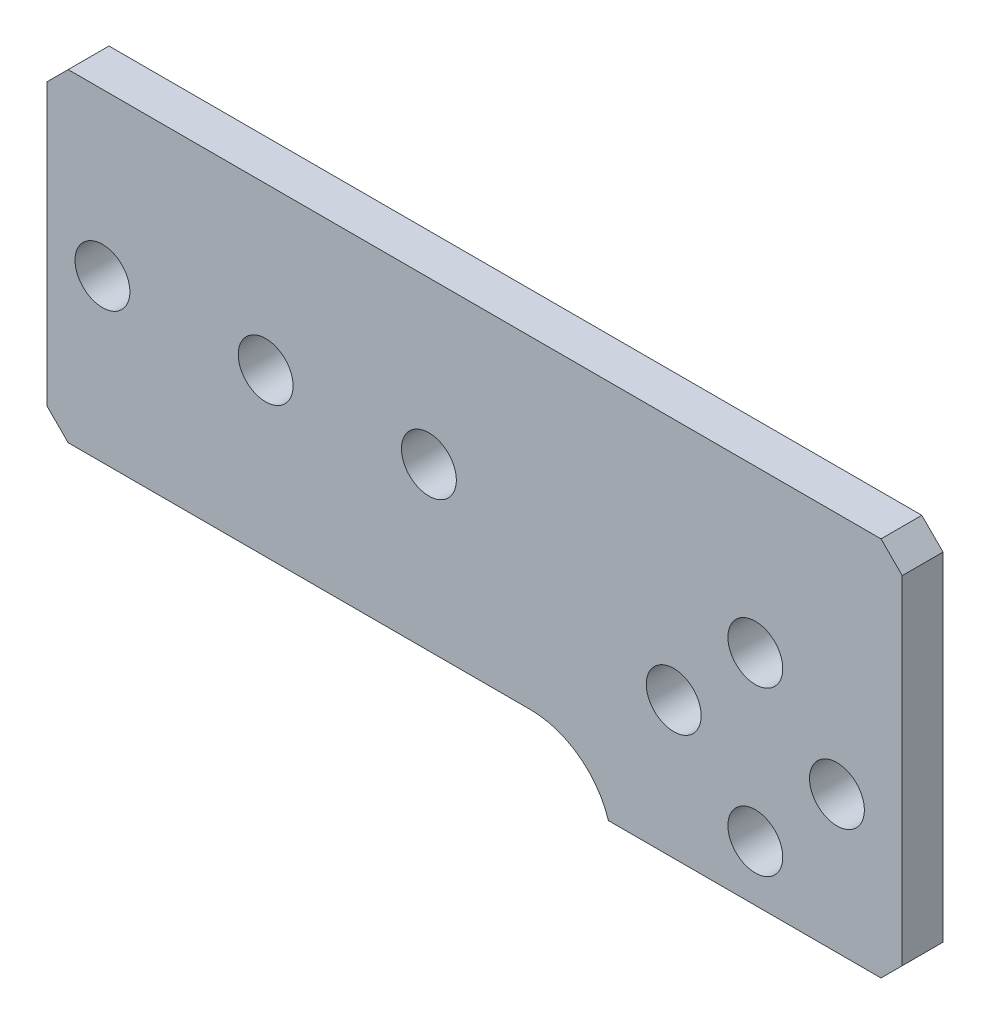
ISO-10303-21;
HEADER;
FILE_DESCRIPTION(('STEP AP214'),'2;1');
FILE_NAME('part.step','',(''),(''),'','','');
FILE_SCHEMA(('AUTOMOTIVE_DESIGN { 1 0 10303 214 1 1 1 1 }'));
ENDSEC;
DATA;
#1=APPLICATION_CONTEXT('core data for automotive mechanical design processes');
#2=APPLICATION_PROTOCOL_DEFINITION('international standard','automotive_design',2000,#1);
#3=PRODUCT_CONTEXT('',#1,'mechanical');
#4=PRODUCT('Part','Part','',(#3));
#5=PRODUCT_RELATED_PRODUCT_CATEGORY('part','',(#4));
#6=PRODUCT_DEFINITION_FORMATION('','',#4);
#7=PRODUCT_DEFINITION_CONTEXT('part definition',#1,'design');
#8=PRODUCT_DEFINITION('design','',#6,#7);
#9=PRODUCT_DEFINITION_SHAPE('','',#8);
#10=(LENGTH_UNIT() NAMED_UNIT(*) SI_UNIT(.MILLI.,.METRE.));
#11=(NAMED_UNIT(*) PLANE_ANGLE_UNIT() SI_UNIT($,.RADIAN.));
#12=(NAMED_UNIT(*) SI_UNIT($,.STERADIAN.) SOLID_ANGLE_UNIT());
#13=UNCERTAINTY_MEASURE_WITH_UNIT(LENGTH_MEASURE(1.E-05),#10,'distance_accuracy_value','');
#14=(GEOMETRIC_REPRESENTATION_CONTEXT(3) GLOBAL_UNCERTAINTY_ASSIGNED_CONTEXT((#13)) GLOBAL_UNIT_ASSIGNED_CONTEXT((#10,
#11,#12)) REPRESENTATION_CONTEXT('',''));
#15=CARTESIAN_POINT('',(0.,0.,0.));
#16=DIRECTION('',(0.,0.,1.));
#17=DIRECTION('',(1.,0.,0.));
#18=AXIS2_PLACEMENT_3D('',#15,#16,#17);
#19=CARTESIAN_POINT('',(0.,0.,1.5875));
#20=DIRECTION('',(0.,0.,1.));
#21=DIRECTION('',(1.,0.,0.));
#22=AXIS2_PLACEMENT_3D('',#19,#20,#21);
#23=PLANE('',#22);
#24=CARTESIAN_POINT('',(25.4,0.,1.5875));
#25=DIRECTION('',(0.,0.,-1.));
#26=DIRECTION('',(-1.,0.,0.));
#27=AXIS2_PLACEMENT_3D('',#24,#25,#26);
#28=CIRCLE('',#27,2.1336);
#29=CARTESIAN_POINT('',(23.2664,0.,1.5875));
#30=VERTEX_POINT('',#29);
#31=EDGE_CURVE('E182',#30,#30,#28,.T.);
#32=ORIENTED_EDGE('',*,*,#31,.T.);
#33=EDGE_LOOP('',(#32));
#34=FACE_BOUND('',#33,.T.);
#35=CARTESIAN_POINT('',(19.05,-6.35,1.5875));
#36=DIRECTION('',(0.,0.,-1.));
#37=DIRECTION('',(-1.,0.,0.));
#38=AXIS2_PLACEMENT_3D('',#35,#36,#37);
#39=CIRCLE('',#38,2.1336);
#40=CARTESIAN_POINT('',(16.9164,-6.35,1.5875));
#41=VERTEX_POINT('',#40);
#42=EDGE_CURVE('E185',#41,#41,#39,.T.);
#43=ORIENTED_EDGE('',*,*,#42,.T.);
#44=EDGE_LOOP('',(#43));
#45=FACE_BOUND('',#44,.T.);
#46=CARTESIAN_POINT('',(25.4,-12.7,1.5875));
#47=DIRECTION('',(0.,0.,-1.));
#48=DIRECTION('',(-1.,0.,0.));
#49=AXIS2_PLACEMENT_3D('',#46,#47,#48);
#50=CIRCLE('',#49,2.1336);
#51=CARTESIAN_POINT('',(23.2664,-12.7,1.5875));
#52=VERTEX_POINT('',#51);
#53=EDGE_CURVE('E115',#52,#52,#50,.T.);
#54=ORIENTED_EDGE('',*,*,#53,.T.);
#55=EDGE_LOOP('',(#54));
#56=FACE_BOUND('',#55,.T.);
#57=CARTESIAN_POINT('',(31.75,-6.35,1.5875));
#58=DIRECTION('',(0.,0.,-1.));
#59=DIRECTION('',(-1.,0.,0.));
#60=AXIS2_PLACEMENT_3D('',#57,#58,#59);
#61=CIRCLE('',#60,2.1336);
#62=CARTESIAN_POINT('',(29.6164,-6.35,1.5875));
#63=VERTEX_POINT('',#62);
#64=EDGE_CURVE('E112',#63,#63,#61,.T.);
#65=ORIENTED_EDGE('',*,*,#64,.T.);
#66=EDGE_LOOP('',(#65));
#67=FACE_BOUND('',#66,.T.);
#68=DIRECTION('',(-1.,0.,0.));
#69=VECTOR('',#68,1.);
#70=CARTESIAN_POINT('',(0.,12.573,1.5875));
#71=LINE('',#70,#69);
#72=CARTESIAN_POINT('',(-28.067,12.573,1.5875));
#73=VERTEX_POINT('',#72);
#74=CARTESIAN_POINT('',(35.179,12.573,1.5875));
#75=VERTEX_POINT('',#74);
#76=EDGE_CURVE('E137',#73,#75,#71,.F.);
#77=ORIENTED_EDGE('',*,*,#76,.F.);
#78=DIRECTION('',(0.707106781186549,0.707106781186546,0.));
#79=VECTOR('',#78,1.);
#80=CARTESIAN_POINT('',(-29.718,10.922,1.5875));
#81=LINE('',#80,#79);
#82=CARTESIAN_POINT('',(-29.718,10.922,1.5875));
#83=VERTEX_POINT('',#82);
#84=EDGE_CURVE('E129',#73,#83,#81,.F.);
#85=ORIENTED_EDGE('',*,*,#84,.T.);
#86=DIRECTION('',(0.,1.,0.));
#87=VECTOR('',#86,1.);
#88=CARTESIAN_POINT('',(-29.718,0.,1.5875));
#89=LINE('',#88,#87);
#90=CARTESIAN_POINT('',(-29.718,-10.922,1.5875));
#91=VERTEX_POINT('',#90);
#92=EDGE_CURVE('E127',#91,#83,#89,.T.);
#93=ORIENTED_EDGE('',*,*,#92,.F.);
#94=DIRECTION('',(0.707106781186545,-0.707106781186551,0.));
#95=VECTOR('',#94,1.);
#96=CARTESIAN_POINT('',(-28.067,-12.573,1.5875));
#97=LINE('',#96,#95);
#98=CARTESIAN_POINT('',(-28.067,-12.573,1.5875));
#99=VERTEX_POINT('',#98);
#100=EDGE_CURVE('E111',#99,#91,#97,.F.);
#101=ORIENTED_EDGE('',*,*,#100,.F.);
#102=DIRECTION('',(-1.,0.,0.));
#103=VECTOR('',#102,1.);
#104=CARTESIAN_POINT('',(0.,-12.573,1.5875));
#105=LINE('',#104,#103);
#106=CARTESIAN_POINT('',(7.91248607100239,-12.573,1.5875));
#107=VERTEX_POINT('',#106);
#108=EDGE_CURVE('E105',#99,#107,#105,.F.);
#109=ORIENTED_EDGE('',*,*,#108,.T.);
#110=CARTESIAN_POINT('',(7.91248607100239,-18.923,1.5875));
#111=DIRECTION('',(0.,0.,-1.));
#112=DIRECTION('',(-1.,0.,0.));
#113=AXIS2_PLACEMENT_3D('',#110,#111,#112);
#114=CIRCLE('',#113,6.35);
#115=CARTESIAN_POINT('',(13.97,-17.018,1.5875));
#116=VERTEX_POINT('',#115);
#117=EDGE_CURVE('E93',#107,#116,#114,.T.);
#118=ORIENTED_EDGE('',*,*,#117,.T.);
#119=DIRECTION('',(1.,0.,0.));
#120=VECTOR('',#119,1.);
#121=CARTESIAN_POINT('',(0.,-17.018,1.5875));
#122=LINE('',#121,#120);
#123=CARTESIAN_POINT('',(35.179,-17.018,1.5875));
#124=VERTEX_POINT('',#123);
#125=EDGE_CURVE('E158',#116,#124,#122,.T.);
#126=ORIENTED_EDGE('',*,*,#125,.T.);
#127=DIRECTION('',(-0.707106781186549,-0.707106781186546,0.));
#128=VECTOR('',#127,1.);
#129=CARTESIAN_POINT('',(36.83,-15.367,1.5875));
#130=LINE('',#129,#128);
#131=CARTESIAN_POINT('',(36.83,-15.367,1.5875));
#132=VERTEX_POINT('',#131);
#133=EDGE_CURVE('E153',#124,#132,#130,.F.);
#134=ORIENTED_EDGE('',*,*,#133,.T.);
#135=DIRECTION('',(0.,1.,0.));
#136=VECTOR('',#135,1.);
#137=CARTESIAN_POINT('',(36.83,0.,1.5875));
#138=LINE('',#137,#136);
#139=CARTESIAN_POINT('',(36.83,10.922,1.5875));
#140=VERTEX_POINT('',#139);
#141=EDGE_CURVE('E145',#132,#140,#138,.T.);
#142=ORIENTED_EDGE('',*,*,#141,.T.);
#143=DIRECTION('',(-0.707106781186546,0.707106781186549,0.));
#144=VECTOR('',#143,1.);
#145=CARTESIAN_POINT('',(35.179,12.573,1.5875));
#146=LINE('',#145,#144);
#147=EDGE_CURVE('E143',#75,#140,#146,.F.);
#148=ORIENTED_EDGE('',*,*,#147,.F.);
#149=EDGE_LOOP('',(#77,#85,#93,#101,#109,#118,#126,#134,#142,#148));
#150=FACE_BOUND('',#149,.T.);
#151=CARTESIAN_POINT('',(0.,0.,1.5875));
#152=DIRECTION('',(0.,0.,-1.));
#153=DIRECTION('',(-1.,0.,0.));
#154=AXIS2_PLACEMENT_3D('',#151,#152,#153);
#155=CIRCLE('',#154,2.1336);
#156=CARTESIAN_POINT('',(-2.1336,0.,1.5875));
#157=VERTEX_POINT('',#156);
#158=EDGE_CURVE('E102',#157,#157,#155,.T.);
#159=ORIENTED_EDGE('',*,*,#158,.T.);
#160=EDGE_LOOP('',(#159));
#161=FACE_BOUND('',#160,.T.);
#162=CARTESIAN_POINT('',(-12.7,0.,1.5875));
#163=DIRECTION('',(0.,0.,-1.));
#164=DIRECTION('',(-1.,0.,0.));
#165=AXIS2_PLACEMENT_3D('',#162,#163,#164);
#166=CIRCLE('',#165,2.1336);
#167=CARTESIAN_POINT('',(-14.8336,0.,1.5875));
#168=VERTEX_POINT('',#167);
#169=EDGE_CURVE('E191',#168,#168,#166,.T.);
#170=ORIENTED_EDGE('',*,*,#169,.T.);
#171=EDGE_LOOP('',(#170));
#172=FACE_BOUND('',#171,.T.);
#173=CARTESIAN_POINT('',(-25.4,-1.77367252013231E-13,1.5875));
#174=DIRECTION('',(0.,0.,-1.));
#175=DIRECTION('',(-1.,0.,0.));
#176=AXIS2_PLACEMENT_3D('',#173,#174,#175);
#177=CIRCLE('',#176,2.1336);
#178=CARTESIAN_POINT('',(-27.5336,-1.77367252013231E-13,1.5875));
#179=VERTEX_POINT('',#178);
#180=EDGE_CURVE('E20',#179,#179,#177,.T.);
#181=ORIENTED_EDGE('',*,*,#180,.T.);
#182=EDGE_LOOP('',(#181));
#183=FACE_BOUND('',#182,.T.);
#184=ADVANCED_FACE('F17',(#34,#45,#56,#67,#150,#161,#172,#183),#23,.T.);
#185=CARTESIAN_POINT('',(-25.4,-1.77367252013231E-13,1.5875));
#186=DIRECTION('',(0.,0.,-1.));
#187=DIRECTION('',(-1.,0.,0.));
#188=AXIS2_PLACEMENT_3D('',#185,#186,#187);
#189=CYLINDRICAL_SURFACE('',#188,2.1336);
#190=CARTESIAN_POINT('',(-25.4,-1.77367252013231E-13,-1.5875));
#191=DIRECTION('',(0.,0.,-1.));
#192=DIRECTION('',(-1.,0.,0.));
#193=AXIS2_PLACEMENT_3D('',#190,#191,#192);
#194=CIRCLE('',#193,2.1336);
#195=CARTESIAN_POINT('',(-27.5336,-1.77367252013231E-13,-1.5875));
#196=VERTEX_POINT('',#195);
#197=EDGE_CURVE('E179',#196,#196,#194,.T.);
#198=ORIENTED_EDGE('',*,*,#197,.T.);
#199=EDGE_LOOP('',(#198));
#200=FACE_BOUND('',#199,.T.);
#201=ORIENTED_EDGE('',*,*,#180,.F.);
#202=EDGE_LOOP('',(#201));
#203=FACE_BOUND('',#202,.T.);
#204=ADVANCED_FACE('F199',(#200,#203),#189,.F.);
#205=CARTESIAN_POINT('',(-12.7,0.,1.5875));
#206=DIRECTION('',(0.,0.,-1.));
#207=DIRECTION('',(-1.,0.,0.));
#208=AXIS2_PLACEMENT_3D('',#205,#206,#207);
#209=CYLINDRICAL_SURFACE('',#208,2.1336);
#210=CARTESIAN_POINT('',(-12.7,0.,-1.5875));
#211=DIRECTION('',(0.,0.,-1.));
#212=DIRECTION('',(-1.,0.,0.));
#213=AXIS2_PLACEMENT_3D('',#210,#211,#212);
#214=CIRCLE('',#213,2.1336);
#215=CARTESIAN_POINT('',(-14.8336,0.,-1.5875));
#216=VERTEX_POINT('',#215);
#217=EDGE_CURVE('E176',#216,#216,#214,.T.);
#218=ORIENTED_EDGE('',*,*,#217,.T.);
#219=EDGE_LOOP('',(#218));
#220=FACE_BOUND('',#219,.T.);
#221=ORIENTED_EDGE('',*,*,#169,.F.);
#222=EDGE_LOOP('',(#221));
#223=FACE_BOUND('',#222,.T.);
#224=ADVANCED_FACE('F201',(#220,#223),#209,.F.);
#225=CARTESIAN_POINT('',(0.,0.,1.5875));
#226=DIRECTION('',(0.,0.,-1.));
#227=DIRECTION('',(-1.,0.,0.));
#228=AXIS2_PLACEMENT_3D('',#225,#226,#227);
#229=CYLINDRICAL_SURFACE('',#228,2.1336);
#230=CARTESIAN_POINT('',(0.,0.,-1.5875));
#231=DIRECTION('',(0.,0.,-1.));
#232=DIRECTION('',(-1.,0.,0.));
#233=AXIS2_PLACEMENT_3D('',#230,#231,#232);
#234=CIRCLE('',#233,2.1336);
#235=CARTESIAN_POINT('',(-2.1336,0.,-1.5875));
#236=VERTEX_POINT('',#235);
#237=EDGE_CURVE('E173',#236,#236,#234,.T.);
#238=ORIENTED_EDGE('',*,*,#237,.T.);
#239=EDGE_LOOP('',(#238));
#240=FACE_BOUND('',#239,.T.);
#241=ORIENTED_EDGE('',*,*,#158,.F.);
#242=EDGE_LOOP('',(#241));
#243=FACE_BOUND('',#242,.T.);
#244=ADVANCED_FACE('F208',(#240,#243),#229,.F.);
#245=CARTESIAN_POINT('',(7.91248607100239,-18.923,1.5875));
#246=DIRECTION('',(0.,0.,-1.));
#247=DIRECTION('',(-1.,0.,0.));
#248=AXIS2_PLACEMENT_3D('',#245,#246,#247);
#249=CYLINDRICAL_SURFACE('',#248,6.35);
#250=DIRECTION('',(0.,0.,1.));
#251=VECTOR('',#250,1.);
#252=CARTESIAN_POINT('',(7.91248607100239,-12.573,1.5875));
#253=LINE('',#252,#251);
#254=CARTESIAN_POINT('',(7.91248607100239,-12.573,-1.5875));
#255=VERTEX_POINT('',#254);
#256=EDGE_CURVE('E97',#107,#255,#253,.F.);
#257=ORIENTED_EDGE('',*,*,#256,.T.);
#258=CARTESIAN_POINT('',(7.91248607100239,-18.923,-1.5875));
#259=DIRECTION('',(0.,0.,-1.));
#260=DIRECTION('',(-1.,0.,0.));
#261=AXIS2_PLACEMENT_3D('',#258,#259,#260);
#262=CIRCLE('',#261,6.35);
#263=CARTESIAN_POINT('',(13.97,-17.018,-1.5875));
#264=VERTEX_POINT('',#263);
#265=EDGE_CURVE('E170',#255,#264,#262,.T.);
#266=ORIENTED_EDGE('',*,*,#265,.T.);
#267=DIRECTION('',(0.,0.,1.));
#268=VECTOR('',#267,1.);
#269=CARTESIAN_POINT('',(13.97,-17.018,1.5875));
#270=LINE('',#269,#268);
#271=EDGE_CURVE('E98',#264,#116,#270,.T.);
#272=ORIENTED_EDGE('',*,*,#271,.T.);
#273=ORIENTED_EDGE('',*,*,#117,.F.);
#274=EDGE_LOOP('',(#257,#266,#272,#273));
#275=FACE_BOUND('',#274,.T.);
#276=ADVANCED_FACE('F95',(#275),#249,.F.);
#277=CARTESIAN_POINT('',(0.,-17.018,1.5875));
#278=DIRECTION('',(0.,1.,0.));
#279=DIRECTION('',(0.,0.,1.));
#280=AXIS2_PLACEMENT_3D('',#277,#278,#279);
#281=PLANE('',#280);
#282=DIRECTION('',(0.,0.,1.));
#283=VECTOR('',#282,1.);
#284=CARTESIAN_POINT('',(35.179,-17.018,1.5875));
#285=LINE('',#284,#283);
#286=CARTESIAN_POINT('',(35.179,-17.018,-1.5875));
#287=VERTEX_POINT('',#286);
#288=EDGE_CURVE('E155',#287,#124,#285,.T.);
#289=ORIENTED_EDGE('',*,*,#288,.T.);
#290=ORIENTED_EDGE('',*,*,#125,.F.);
#291=ORIENTED_EDGE('',*,*,#271,.F.);
#292=DIRECTION('',(1.,0.,0.));
#293=VECTOR('',#292,1.);
#294=CARTESIAN_POINT('',(0.,-17.018,-1.5875));
#295=LINE('',#294,#293);
#296=EDGE_CURVE('E172',#264,#287,#295,.T.);
#297=ORIENTED_EDGE('',*,*,#296,.T.);
#298=EDGE_LOOP('',(#289,#290,#291,#297));
#299=FACE_BOUND('',#298,.T.);
#300=ADVANCED_FACE('F266',(#299),#281,.F.);
#301=CARTESIAN_POINT('',(36.83,-15.367,1.5875));
#302=DIRECTION('',(-0.707106781186546,0.707106781186549,0.));
#303=DIRECTION('',(-0.707106781186549,-0.707106781186546,0.));
#304=AXIS2_PLACEMENT_3D('',#301,#302,#303);
#305=PLANE('',#304);
#306=ORIENTED_EDGE('',*,*,#288,.F.);
#307=DIRECTION('',(0.707106781186549,0.707106781186546,0.));
#308=VECTOR('',#307,1.);
#309=CARTESIAN_POINT('',(35.179,-17.018,-1.5875));
#310=LINE('',#309,#308);
#311=CARTESIAN_POINT('',(36.83,-15.367,-1.5875));
#312=VERTEX_POINT('',#311);
#313=EDGE_CURVE('E412',#287,#312,#310,.T.);
#314=ORIENTED_EDGE('',*,*,#313,.T.);
#315=DIRECTION('',(0.,0.,1.));
#316=VECTOR('',#315,1.);
#317=CARTESIAN_POINT('',(36.83,-15.367,1.5875));
#318=LINE('',#317,#316);
#319=EDGE_CURVE('E150',#312,#132,#318,.T.);
#320=ORIENTED_EDGE('',*,*,#319,.T.);
#321=ORIENTED_EDGE('',*,*,#133,.F.);
#322=EDGE_LOOP('',(#306,#314,#320,#321));
#323=FACE_BOUND('',#322,.T.);
#324=ADVANCED_FACE('F262',(#323),#305,.F.);
#325=CARTESIAN_POINT('',(36.83,0.,1.5875));
#326=DIRECTION('',(-1.,0.,0.));
#327=DIRECTION('',(0.,0.,1.));
#328=AXIS2_PLACEMENT_3D('',#325,#326,#327);
#329=PLANE('',#328);
#330=DIRECTION('',(0.,0.,1.));
#331=VECTOR('',#330,1.);
#332=CARTESIAN_POINT('',(36.83,10.922,1.5875));
#333=LINE('',#332,#331);
#334=CARTESIAN_POINT('',(36.83,10.922,-1.5875));
#335=VERTEX_POINT('',#334);
#336=EDGE_CURVE('E140',#140,#335,#333,.F.);
#337=ORIENTED_EDGE('',*,*,#336,.F.);
#338=ORIENTED_EDGE('',*,*,#141,.F.);
#339=ORIENTED_EDGE('',*,*,#319,.F.);
#340=DIRECTION('',(0.,1.,0.));
#341=VECTOR('',#340,1.);
#342=CARTESIAN_POINT('',(36.83,0.,-1.5875));
#343=LINE('',#342,#341);
#344=EDGE_CURVE('E414',#312,#335,#343,.T.);
#345=ORIENTED_EDGE('',*,*,#344,.T.);
#346=EDGE_LOOP('',(#337,#338,#339,#345));
#347=FACE_BOUND('',#346,.T.);
#348=ADVANCED_FACE('F258',(#347),#329,.F.);
#349=CARTESIAN_POINT('',(35.179,12.573,1.5875));
#350=DIRECTION('',(0.707106781186549,0.707106781186546,0.));
#351=DIRECTION('',(-0.707106781186546,0.707106781186549,0.));
#352=AXIS2_PLACEMENT_3D('',#349,#350,#351);
#353=PLANE('',#352);
#354=DIRECTION('',(-0.707106781186546,0.707106781186549,0.));
#355=VECTOR('',#354,1.);
#356=CARTESIAN_POINT('',(36.83,10.922,-1.5875));
#357=LINE('',#356,#355);
#358=CARTESIAN_POINT('',(35.179,12.573,-1.5875));
#359=VERTEX_POINT('',#358);
#360=EDGE_CURVE('E423',#335,#359,#357,.T.);
#361=ORIENTED_EDGE('',*,*,#360,.T.);
#362=DIRECTION('',(0.,0.,1.));
#363=VECTOR('',#362,1.);
#364=CARTESIAN_POINT('',(35.179,12.573,1.5875));
#365=LINE('',#364,#363);
#366=EDGE_CURVE('E139',#75,#359,#365,.F.);
#367=ORIENTED_EDGE('',*,*,#366,.F.);
#368=ORIENTED_EDGE('',*,*,#147,.T.);
#369=ORIENTED_EDGE('',*,*,#336,.T.);
#370=EDGE_LOOP('',(#361,#367,#368,#369));
#371=FACE_BOUND('',#370,.T.);
#372=ADVANCED_FACE('F254',(#371),#353,.T.);
#373=CARTESIAN_POINT('',(0.,12.573,1.5875));
#374=DIRECTION('',(0.,1.,0.));
#375=DIRECTION('',(-1.,0.,0.));
#376=AXIS2_PLACEMENT_3D('',#373,#374,#375);
#377=PLANE('',#376);
#378=ORIENTED_EDGE('',*,*,#76,.T.);
#379=ORIENTED_EDGE('',*,*,#366,.T.);
#380=DIRECTION('',(1.,0.,0.));
#381=VECTOR('',#380,1.);
#382=CARTESIAN_POINT('',(0.,12.573,-1.5875));
#383=LINE('',#382,#381);
#384=CARTESIAN_POINT('',(-28.067,12.573,-1.5875));
#385=VERTEX_POINT('',#384);
#386=EDGE_CURVE('E431',#359,#385,#383,.F.);
#387=ORIENTED_EDGE('',*,*,#386,.T.);
#388=DIRECTION('',(0.,0.,1.));
#389=VECTOR('',#388,1.);
#390=CARTESIAN_POINT('',(-28.067,12.573,1.5875));
#391=LINE('',#390,#389);
#392=EDGE_CURVE('E134',#385,#73,#391,.T.);
#393=ORIENTED_EDGE('',*,*,#392,.T.);
#394=EDGE_LOOP('',(#378,#379,#387,#393));
#395=FACE_BOUND('',#394,.T.);
#396=ADVANCED_FACE('F250',(#395),#377,.T.);
#397=CARTESIAN_POINT('',(-29.718,10.922,1.5875));
#398=DIRECTION('',(0.707106781186546,-0.707106781186549,0.));
#399=DIRECTION('',(0.707106781186549,0.707106781186546,0.));
#400=AXIS2_PLACEMENT_3D('',#397,#398,#399);
#401=PLANE('',#400);
#402=ORIENTED_EDGE('',*,*,#392,.F.);
#403=DIRECTION('',(-0.70710678118655,-0.707106781186545,0.));
#404=VECTOR('',#403,1.);
#405=CARTESIAN_POINT('',(-28.067,12.573,-1.5875));
#406=LINE('',#405,#404);
#407=CARTESIAN_POINT('',(-29.718,10.922,-1.5875));
#408=VERTEX_POINT('',#407);
#409=EDGE_CURVE('E439',#385,#408,#406,.T.);
#410=ORIENTED_EDGE('',*,*,#409,.T.);
#411=DIRECTION('',(0.,0.,1.));
#412=VECTOR('',#411,1.);
#413=CARTESIAN_POINT('',(-29.718,10.922,1.5875));
#414=LINE('',#413,#412);
#415=EDGE_CURVE('E124',#83,#408,#414,.F.);
#416=ORIENTED_EDGE('',*,*,#415,.F.);
#417=ORIENTED_EDGE('',*,*,#84,.F.);
#418=EDGE_LOOP('',(#402,#410,#416,#417));
#419=FACE_BOUND('',#418,.T.);
#420=ADVANCED_FACE('F246',(#419),#401,.F.);
#421=CARTESIAN_POINT('',(-29.718,0.,1.5875));
#422=DIRECTION('',(-1.,0.,0.));
#423=DIRECTION('',(0.,0.,1.));
#424=AXIS2_PLACEMENT_3D('',#421,#422,#423);
#425=PLANE('',#424);
#426=ORIENTED_EDGE('',*,*,#92,.T.);
#427=ORIENTED_EDGE('',*,*,#415,.T.);
#428=DIRECTION('',(0.,1.,0.));
#429=VECTOR('',#428,1.);
#430=CARTESIAN_POINT('',(-29.718,0.,-1.5875));
#431=LINE('',#430,#429);
#432=CARTESIAN_POINT('',(-29.718,-10.922,-1.5875));
#433=VERTEX_POINT('',#432);
#434=EDGE_CURVE('E448',#408,#433,#431,.F.);
#435=ORIENTED_EDGE('',*,*,#434,.T.);
#436=DIRECTION('',(0.,0.,1.));
#437=VECTOR('',#436,1.);
#438=CARTESIAN_POINT('',(-29.718,-10.922,1.5875));
#439=LINE('',#438,#437);
#440=EDGE_CURVE('E107',#91,#433,#439,.F.);
#441=ORIENTED_EDGE('',*,*,#440,.F.);
#442=EDGE_LOOP('',(#426,#427,#435,#441));
#443=FACE_BOUND('',#442,.T.);
#444=ADVANCED_FACE('F242',(#443),#425,.T.);
#445=CARTESIAN_POINT('',(-28.067,-12.573,1.5875));
#446=DIRECTION('',(-0.707106781186551,-0.707106781186545,0.));
#447=DIRECTION('',(0.707106781186545,-0.707106781186551,0.));
#448=AXIS2_PLACEMENT_3D('',#445,#446,#447);
#449=PLANE('',#448);
#450=DIRECTION('',(0.707106781186545,-0.70710678118655,0.));
#451=VECTOR('',#450,1.);
#452=CARTESIAN_POINT('',(-29.718,-10.922,-1.5875));
#453=LINE('',#452,#451);
#454=CARTESIAN_POINT('',(-28.067,-12.573,-1.5875));
#455=VERTEX_POINT('',#454);
#456=EDGE_CURVE('E456',#433,#455,#453,.T.);
#457=ORIENTED_EDGE('',*,*,#456,.T.);
#458=DIRECTION('',(0.,0.,1.));
#459=VECTOR('',#458,1.);
#460=CARTESIAN_POINT('',(-28.067,-12.573,1.5875));
#461=LINE('',#460,#459);
#462=EDGE_CURVE('E35',#455,#99,#461,.T.);
#463=ORIENTED_EDGE('',*,*,#462,.T.);
#464=ORIENTED_EDGE('',*,*,#100,.T.);
#465=ORIENTED_EDGE('',*,*,#440,.T.);
#466=EDGE_LOOP('',(#457,#463,#464,#465));
#467=FACE_BOUND('',#466,.T.);
#468=ADVANCED_FACE('F239',(#467),#449,.T.);
#469=CARTESIAN_POINT('',(0.,-12.573,1.5875));
#470=DIRECTION('',(0.,1.,0.));
#471=DIRECTION('',(-1.,0.,0.));
#472=AXIS2_PLACEMENT_3D('',#469,#470,#471);
#473=PLANE('',#472);
#474=ORIENTED_EDGE('',*,*,#462,.F.);
#475=DIRECTION('',(1.,0.,0.));
#476=VECTOR('',#475,1.);
#477=CARTESIAN_POINT('',(0.,-12.573,-1.5875));
#478=LINE('',#477,#476);
#479=EDGE_CURVE('E106',#455,#255,#478,.T.);
#480=ORIENTED_EDGE('',*,*,#479,.T.);
#481=ORIENTED_EDGE('',*,*,#256,.F.);
#482=ORIENTED_EDGE('',*,*,#108,.F.);
#483=EDGE_LOOP('',(#474,#480,#481,#482));
#484=FACE_BOUND('',#483,.T.);
#485=ADVANCED_FACE('F104',(#484),#473,.F.);
#486=CARTESIAN_POINT('',(31.75,-6.35,1.5875));
#487=DIRECTION('',(0.,0.,-1.));
#488=DIRECTION('',(-1.,0.,0.));
#489=AXIS2_PLACEMENT_3D('',#486,#487,#488);
#490=CYLINDRICAL_SURFACE('',#489,2.1336);
#491=CARTESIAN_POINT('',(31.75,-6.35,-1.5875));
#492=DIRECTION('',(0.,0.,-1.));
#493=DIRECTION('',(-1.,0.,0.));
#494=AXIS2_PLACEMENT_3D('',#491,#492,#493);
#495=CIRCLE('',#494,2.1336);
#496=CARTESIAN_POINT('',(29.6164,-6.35,-1.5875));
#497=VERTEX_POINT('',#496);
#498=EDGE_CURVE('E167',#497,#497,#495,.T.);
#499=ORIENTED_EDGE('',*,*,#498,.T.);
#500=EDGE_LOOP('',(#499));
#501=FACE_BOUND('',#500,.T.);
#502=ORIENTED_EDGE('',*,*,#64,.F.);
#503=EDGE_LOOP('',(#502));
#504=FACE_BOUND('',#503,.T.);
#505=ADVANCED_FACE('F232',(#501,#504),#490,.F.);
#506=CARTESIAN_POINT('',(25.4,-12.7,1.5875));
#507=DIRECTION('',(0.,0.,-1.));
#508=DIRECTION('',(-1.,0.,0.));
#509=AXIS2_PLACEMENT_3D('',#506,#507,#508);
#510=CYLINDRICAL_SURFACE('',#509,2.1336);
#511=CARTESIAN_POINT('',(25.4,-12.7,-1.5875));
#512=DIRECTION('',(0.,0.,-1.));
#513=DIRECTION('',(-1.,0.,0.));
#514=AXIS2_PLACEMENT_3D('',#511,#512,#513);
#515=CIRCLE('',#514,2.1336);
#516=CARTESIAN_POINT('',(23.2664,-12.7,-1.5875));
#517=VERTEX_POINT('',#516);
#518=EDGE_CURVE('E164',#517,#517,#515,.T.);
#519=ORIENTED_EDGE('',*,*,#518,.T.);
#520=EDGE_LOOP('',(#519));
#521=FACE_BOUND('',#520,.T.);
#522=ORIENTED_EDGE('',*,*,#53,.F.);
#523=EDGE_LOOP('',(#522));
#524=FACE_BOUND('',#523,.T.);
#525=ADVANCED_FACE('F228',(#521,#524),#510,.F.);
#526=CARTESIAN_POINT('',(19.05,-6.35,1.5875));
#527=DIRECTION('',(0.,0.,-1.));
#528=DIRECTION('',(-1.,0.,0.));
#529=AXIS2_PLACEMENT_3D('',#526,#527,#528);
#530=CYLINDRICAL_SURFACE('',#529,2.1336);
#531=CARTESIAN_POINT('',(19.05,-6.35,-1.5875));
#532=DIRECTION('',(0.,0.,-1.));
#533=DIRECTION('',(-1.,0.,0.));
#534=AXIS2_PLACEMENT_3D('',#531,#532,#533);
#535=CIRCLE('',#534,2.1336);
#536=CARTESIAN_POINT('',(16.9164,-6.35,-1.5875));
#537=VERTEX_POINT('',#536);
#538=EDGE_CURVE('E26',#537,#537,#535,.T.);
#539=ORIENTED_EDGE('',*,*,#538,.T.);
#540=EDGE_LOOP('',(#539));
#541=FACE_BOUND('',#540,.T.);
#542=ORIENTED_EDGE('',*,*,#42,.F.);
#543=EDGE_LOOP('',(#542));
#544=FACE_BOUND('',#543,.T.);
#545=ADVANCED_FACE('F220',(#541,#544),#530,.F.);
#546=CARTESIAN_POINT('',(25.4,0.,1.5875));
#547=DIRECTION('',(0.,0.,-1.));
#548=DIRECTION('',(-1.,0.,0.));
#549=AXIS2_PLACEMENT_3D('',#546,#547,#548);
#550=CYLINDRICAL_SURFACE('',#549,2.1336);
#551=CARTESIAN_POINT('',(25.4,0.,-1.5875));
#552=DIRECTION('',(0.,0.,-1.));
#553=DIRECTION('',(-1.,0.,0.));
#554=AXIS2_PLACEMENT_3D('',#551,#552,#553);
#555=CIRCLE('',#554,2.1336);
#556=CARTESIAN_POINT('',(23.2664,0.,-1.5875));
#557=VERTEX_POINT('',#556);
#558=EDGE_CURVE('E11',#557,#557,#555,.T.);
#559=ORIENTED_EDGE('',*,*,#558,.T.);
#560=EDGE_LOOP('',(#559));
#561=FACE_BOUND('',#560,.T.);
#562=ORIENTED_EDGE('',*,*,#31,.F.);
#563=EDGE_LOOP('',(#562));
#564=FACE_BOUND('',#563,.T.);
#565=ADVANCED_FACE('F214',(#561,#564),#550,.F.);
#566=CARTESIAN_POINT('',(0.,0.,-1.5875));
#567=DIRECTION('',(0.,0.,1.));
#568=DIRECTION('',(1.,0.,0.));
#569=AXIS2_PLACEMENT_3D('',#566,#567,#568);
#570=PLANE('',#569);
#571=ORIENTED_EDGE('',*,*,#558,.F.);
#572=EDGE_LOOP('',(#571));
#573=FACE_BOUND('',#572,.T.);
#574=ORIENTED_EDGE('',*,*,#538,.F.);
#575=EDGE_LOOP('',(#574));
#576=FACE_BOUND('',#575,.T.);
#577=ORIENTED_EDGE('',*,*,#518,.F.);
#578=EDGE_LOOP('',(#577));
#579=FACE_BOUND('',#578,.T.);
#580=ORIENTED_EDGE('',*,*,#498,.F.);
#581=EDGE_LOOP('',(#580));
#582=FACE_BOUND('',#581,.T.);
#583=ORIENTED_EDGE('',*,*,#456,.F.);
#584=ORIENTED_EDGE('',*,*,#434,.F.);
#585=ORIENTED_EDGE('',*,*,#409,.F.);
#586=ORIENTED_EDGE('',*,*,#386,.F.);
#587=ORIENTED_EDGE('',*,*,#360,.F.);
#588=ORIENTED_EDGE('',*,*,#344,.F.);
#589=ORIENTED_EDGE('',*,*,#313,.F.);
#590=ORIENTED_EDGE('',*,*,#296,.F.);
#591=ORIENTED_EDGE('',*,*,#265,.F.);
#592=ORIENTED_EDGE('',*,*,#479,.F.);
#593=EDGE_LOOP('',(#583,#584,#585,#586,#587,#588,#589,#590,#591,#592));
#594=FACE_BOUND('',#593,.T.);
#595=ORIENTED_EDGE('',*,*,#237,.F.);
#596=EDGE_LOOP('',(#595));
#597=FACE_BOUND('',#596,.T.);
#598=ORIENTED_EDGE('',*,*,#217,.F.);
#599=EDGE_LOOP('',(#598));
#600=FACE_BOUND('',#599,.T.);
#601=ORIENTED_EDGE('',*,*,#197,.F.);
#602=EDGE_LOOP('',(#601));
#603=FACE_BOUND('',#602,.T.);
#604=ADVANCED_FACE('F212',(#573,#576,#579,#582,#594,#597,#600,#603),#570,.F.);
#605=CLOSED_SHELL('',(#184,#204,#224,#244,#276,#300,#324,#348,#372,#396,#420,#444,#468,#485,
#505,#525,#545,#565,#604));
#606=MANIFOLD_SOLID_BREP('B1',#605);
#607=ADVANCED_BREP_SHAPE_REPRESENTATION('',(#18,#606),#14);
#608=SHAPE_DEFINITION_REPRESENTATION(#9,#607);
ENDSEC;
END-ISO-10303-21;
